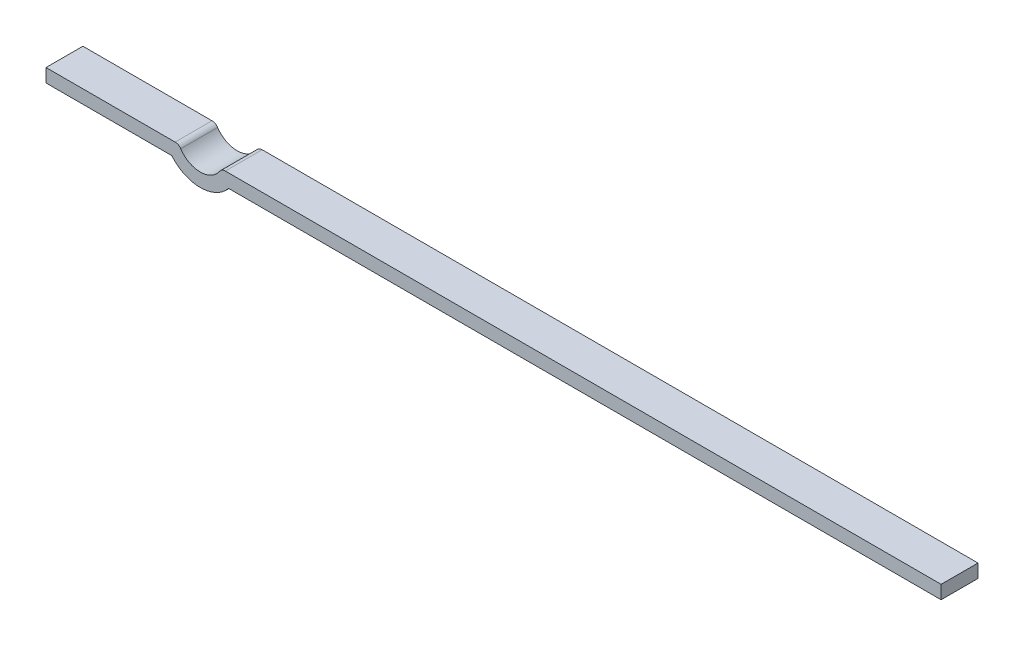
ISO-10303-21;
HEADER;
FILE_DESCRIPTION(('STEP AP214'),'2;1');
FILE_NAME('part.step','',(''),(''),'','','');
FILE_SCHEMA(('AUTOMOTIVE_DESIGN { 1 0 10303 214 1 1 1 1 }'));
ENDSEC;
DATA;
#1=APPLICATION_CONTEXT('core data for automotive mechanical design processes');
#2=APPLICATION_PROTOCOL_DEFINITION('international standard','automotive_design',2000,#1);
#3=PRODUCT_CONTEXT('',#1,'mechanical');
#4=PRODUCT('Part','Part','',(#3));
#5=PRODUCT_RELATED_PRODUCT_CATEGORY('part','',(#4));
#6=PRODUCT_DEFINITION_FORMATION('','',#4);
#7=PRODUCT_DEFINITION_CONTEXT('part definition',#1,'design');
#8=PRODUCT_DEFINITION('design','',#6,#7);
#9=PRODUCT_DEFINITION_SHAPE('','',#8);
#10=(LENGTH_UNIT() NAMED_UNIT(*) SI_UNIT(.MILLI.,.METRE.));
#11=(NAMED_UNIT(*) PLANE_ANGLE_UNIT() SI_UNIT($,.RADIAN.));
#12=(NAMED_UNIT(*) SI_UNIT($,.STERADIAN.) SOLID_ANGLE_UNIT());
#13=UNCERTAINTY_MEASURE_WITH_UNIT(LENGTH_MEASURE(1.E-05),#10,'distance_accuracy_value','');
#14=(GEOMETRIC_REPRESENTATION_CONTEXT(3) GLOBAL_UNCERTAINTY_ASSIGNED_CONTEXT((#13)) GLOBAL_UNIT_ASSIGNED_CONTEXT((#10,
#11,#12)) REPRESENTATION_CONTEXT('',''));
#15=CARTESIAN_POINT('',(0.,0.,0.));
#16=DIRECTION('',(0.,0.,1.));
#17=DIRECTION('',(1.,0.,0.));
#18=AXIS2_PLACEMENT_3D('',#15,#16,#17);
#19=CARTESIAN_POINT('',(6.675,-0.1,0.55));
#20=DIRECTION('',(-1.,0.,0.));
#21=DIRECTION('',(0.,0.,1.));
#22=AXIS2_PLACEMENT_3D('',#19,#20,#21);
#23=PLANE('',#22);
#24=DIRECTION('',(0.,1.,0.));
#25=VECTOR('',#24,1.);
#26=CARTESIAN_POINT('',(6.675,-0.1,0.));
#27=LINE('',#26,#25);
#28=CARTESIAN_POINT('',(6.675,-0.1,0.));
#29=VERTEX_POINT('',#28);
#30=CARTESIAN_POINT('',(6.675,0.1,0.));
#31=VERTEX_POINT('',#30);
#32=EDGE_CURVE('E140',#29,#31,#27,.T.);
#33=ORIENTED_EDGE('',*,*,#32,.T.);
#34=DIRECTION('',(0.,0.,-1.));
#35=VECTOR('',#34,1.);
#36=CARTESIAN_POINT('',(6.675,0.1,0.55));
#37=LINE('',#36,#35);
#38=CARTESIAN_POINT('',(6.675,0.1,0.55));
#39=VERTEX_POINT('',#38);
#40=EDGE_CURVE('E11',#39,#31,#37,.T.);
#41=ORIENTED_EDGE('',*,*,#40,.F.);
#42=DIRECTION('',(0.,1.,0.));
#43=VECTOR('',#42,1.);
#44=CARTESIAN_POINT('',(6.675,-0.1,0.55));
#45=LINE('',#44,#43);
#46=CARTESIAN_POINT('',(6.675,-0.1,0.55));
#47=VERTEX_POINT('',#46);
#48=EDGE_CURVE('E158',#47,#39,#45,.T.);
#49=ORIENTED_EDGE('',*,*,#48,.F.);
#50=DIRECTION('',(0.,0.,-1.));
#51=VECTOR('',#50,1.);
#52=CARTESIAN_POINT('',(6.675,-0.1,0.55));
#53=LINE('',#52,#51);
#54=EDGE_CURVE('E136',#47,#29,#53,.T.);
#55=ORIENTED_EDGE('',*,*,#54,.T.);
#56=EDGE_LOOP('',(#33,#41,#49,#55));
#57=FACE_BOUND('',#56,.T.);
#58=ADVANCED_FACE('F32',(#57),#23,.F.);
#59=CARTESIAN_POINT('',(-4.00059565600384,0.1,0.55));
#60=DIRECTION('',(0.,-1.,0.));
#61=DIRECTION('',(1.,0.,0.));
#62=AXIS2_PLACEMENT_3D('',#59,#60,#61);
#63=PLANE('',#62);
#64=DIRECTION('',(-1.,0.,0.));
#65=VECTOR('',#64,1.);
#66=CARTESIAN_POINT('',(-4.00059565600384,0.1,0.));
#67=LINE('',#66,#65);
#68=CARTESIAN_POINT('',(-4.00059565600384,0.1,0.));
#69=VERTEX_POINT('',#68);
#70=EDGE_CURVE('E143',#31,#69,#67,.T.);
#71=ORIENTED_EDGE('',*,*,#70,.T.);
#72=DIRECTION('',(0.,0.,-1.));
#73=VECTOR('',#72,1.);
#74=CARTESIAN_POINT('',(-4.00059565600384,0.1,0.55));
#75=LINE('',#74,#73);
#76=CARTESIAN_POINT('',(-4.00059565600384,0.1,0.55));
#77=VERTEX_POINT('',#76);
#78=EDGE_CURVE('E40',#77,#69,#75,.T.);
#79=ORIENTED_EDGE('',*,*,#78,.F.);
#80=DIRECTION('',(-1.,0.,0.));
#81=VECTOR('',#80,1.);
#82=CARTESIAN_POINT('',(-4.00059565600384,0.1,0.55));
#83=LINE('',#82,#81);
#84=EDGE_CURVE('E97',#39,#77,#83,.T.);
#85=ORIENTED_EDGE('',*,*,#84,.F.);
#86=ORIENTED_EDGE('',*,*,#40,.T.);
#87=EDGE_LOOP('',(#71,#79,#85,#86));
#88=FACE_BOUND('',#87,.T.);
#89=ADVANCED_FACE('F207',(#88),#63,.F.);
#90=CARTESIAN_POINT('',(-4.00059565600384,0.,0.55));
#91=DIRECTION('',(0.,0.,-1.));
#92=DIRECTION('',(-1.,0.,0.));
#93=AXIS2_PLACEMENT_3D('',#90,#91,#92);
#94=CYLINDRICAL_SURFACE('',#93,0.1);
#95=CARTESIAN_POINT('',(-4.00059565600384,0.,0.));
#96=DIRECTION('',(0.,0.,1.));
#97=DIRECTION('',(-1.,0.,0.));
#98=AXIS2_PLACEMENT_3D('',#95,#96,#97);
#99=CIRCLE('',#98,0.1);
#100=CARTESIAN_POINT('',(-4.08374106578076,0.0555593451457745,0.));
#101=VERTEX_POINT('',#100);
#102=EDGE_CURVE('E145',#69,#101,#99,.T.);
#103=ORIENTED_EDGE('',*,*,#102,.T.);
#104=DIRECTION('',(0.,0.,-1.));
#105=VECTOR('',#104,1.);
#106=CARTESIAN_POINT('',(-4.08374106578076,0.0555593451457745,0.55));
#107=LINE('',#106,#105);
#108=CARTESIAN_POINT('',(-4.08374106578076,0.0555593451457745,0.55));
#109=VERTEX_POINT('',#108);
#110=EDGE_CURVE('E171',#109,#101,#107,.T.);
#111=ORIENTED_EDGE('',*,*,#110,.F.);
#112=CARTESIAN_POINT('',(-4.00059565600384,0.,0.55));
#113=DIRECTION('',(0.,0.,1.));
#114=DIRECTION('',(-1.,0.,0.));
#115=AXIS2_PLACEMENT_3D('',#112,#113,#114);
#116=CIRCLE('',#115,0.1);
#117=EDGE_CURVE('E179',#77,#109,#116,.T.);
#118=ORIENTED_EDGE('',*,*,#117,.F.);
#119=ORIENTED_EDGE('',*,*,#78,.T.);
#120=EDGE_LOOP('',(#103,#111,#118,#119));
#121=FACE_BOUND('',#120,.T.);
#122=ADVANCED_FACE('F177',(#121),#94,.T.);
#123=CARTESIAN_POINT('',(-4.37475,0.250017053155985,0.55));
#124=DIRECTION('',(0.,0.,-1.));
#125=DIRECTION('',(-1.,0.,0.));
#126=AXIS2_PLACEMENT_3D('',#123,#124,#125);
#127=CYLINDRICAL_SURFACE('',#126,0.35);
#128=CARTESIAN_POINT('',(-4.37475,0.250017053155985,0.));
#129=DIRECTION('',(0.,0.,-1.));
#130=DIRECTION('',(1.,0.,0.));
#131=AXIS2_PLACEMENT_3D('',#128,#129,#130);
#132=CIRCLE('',#131,0.35);
#133=CARTESIAN_POINT('',(-4.66575893421924,0.0555593451457747,0.));
#134=VERTEX_POINT('',#133);
#135=EDGE_CURVE('E147',#101,#134,#132,.T.);
#136=ORIENTED_EDGE('',*,*,#135,.T.);
#137=DIRECTION('',(0.,0.,-1.));
#138=VECTOR('',#137,1.);
#139=CARTESIAN_POINT('',(-4.66575893421924,0.0555593451457747,0.55));
#140=LINE('',#139,#138);
#141=CARTESIAN_POINT('',(-4.66575893421924,0.0555593451457747,0.55));
#142=VERTEX_POINT('',#141);
#143=EDGE_CURVE('E168',#142,#134,#140,.T.);
#144=ORIENTED_EDGE('',*,*,#143,.F.);
#145=CARTESIAN_POINT('',(-4.37475,0.250017053155985,0.55));
#146=DIRECTION('',(0.,0.,-1.));
#147=DIRECTION('',(1.,0.,0.));
#148=AXIS2_PLACEMENT_3D('',#145,#146,#147);
#149=CIRCLE('',#148,0.35);
#150=EDGE_CURVE('E197',#109,#142,#149,.T.);
#151=ORIENTED_EDGE('',*,*,#150,.F.);
#152=ORIENTED_EDGE('',*,*,#110,.T.);
#153=EDGE_LOOP('',(#136,#144,#151,#152));
#154=FACE_BOUND('',#153,.T.);
#155=ADVANCED_FACE('F188',(#154),#127,.F.);
#156=CARTESIAN_POINT('',(-4.74890434399616,0.,0.55));
#157=DIRECTION('',(0.,0.,-1.));
#158=DIRECTION('',(-1.,0.,0.));
#159=AXIS2_PLACEMENT_3D('',#156,#157,#158);
#160=CYLINDRICAL_SURFACE('',#159,0.1);
#161=CARTESIAN_POINT('',(-4.74890434399616,0.,0.));
#162=DIRECTION('',(0.,0.,1.));
#163=DIRECTION('',(1.,0.,0.));
#164=AXIS2_PLACEMENT_3D('',#161,#162,#163);
#165=CIRCLE('',#164,0.1);
#166=CARTESIAN_POINT('',(-4.74890434399616,0.1,0.));
#167=VERTEX_POINT('',#166);
#168=EDGE_CURVE('E149',#134,#167,#165,.T.);
#169=ORIENTED_EDGE('',*,*,#168,.T.);
#170=DIRECTION('',(0.,0.,-1.));
#171=VECTOR('',#170,1.);
#172=CARTESIAN_POINT('',(-4.74890434399616,0.1,0.55));
#173=LINE('',#172,#171);
#174=CARTESIAN_POINT('',(-4.74890434399616,0.1,0.55));
#175=VERTEX_POINT('',#174);
#176=EDGE_CURVE('E165',#175,#167,#173,.T.);
#177=ORIENTED_EDGE('',*,*,#176,.F.);
#178=CARTESIAN_POINT('',(-4.74890434399616,0.,0.55));
#179=DIRECTION('',(0.,0.,1.));
#180=DIRECTION('',(1.,0.,0.));
#181=AXIS2_PLACEMENT_3D('',#178,#179,#180);
#182=CIRCLE('',#181,0.1);
#183=EDGE_CURVE('E194',#142,#175,#182,.T.);
#184=ORIENTED_EDGE('',*,*,#183,.F.);
#185=ORIENTED_EDGE('',*,*,#143,.T.);
#186=EDGE_LOOP('',(#169,#177,#184,#185));
#187=FACE_BOUND('',#186,.T.);
#188=ADVANCED_FACE('F192',(#187),#160,.T.);
#189=CARTESIAN_POINT('',(-6.675,0.1,0.55));
#190=DIRECTION('',(0.,-1.,0.));
#191=DIRECTION('',(1.,0.,0.));
#192=AXIS2_PLACEMENT_3D('',#189,#190,#191);
#193=PLANE('',#192);
#194=DIRECTION('',(-1.,0.,0.));
#195=VECTOR('',#194,1.);
#196=CARTESIAN_POINT('',(-6.675,0.1,0.));
#197=LINE('',#196,#195);
#198=CARTESIAN_POINT('',(-6.675,0.1,0.));
#199=VERTEX_POINT('',#198);
#200=EDGE_CURVE('E151',#167,#199,#197,.T.);
#201=ORIENTED_EDGE('',*,*,#200,.T.);
#202=DIRECTION('',(0.,0.,-1.));
#203=VECTOR('',#202,1.);
#204=CARTESIAN_POINT('',(-6.675,0.1,0.55));
#205=LINE('',#204,#203);
#206=CARTESIAN_POINT('',(-6.675,0.1,0.55));
#207=VERTEX_POINT('',#206);
#208=EDGE_CURVE('E162',#207,#199,#205,.T.);
#209=ORIENTED_EDGE('',*,*,#208,.F.);
#210=DIRECTION('',(-1.,0.,0.));
#211=VECTOR('',#210,1.);
#212=CARTESIAN_POINT('',(-6.675,0.1,0.55));
#213=LINE('',#212,#211);
#214=EDGE_CURVE('E196',#175,#207,#213,.T.);
#215=ORIENTED_EDGE('',*,*,#214,.F.);
#216=ORIENTED_EDGE('',*,*,#176,.T.);
#217=EDGE_LOOP('',(#201,#209,#215,#216));
#218=FACE_BOUND('',#217,.T.);
#219=ADVANCED_FACE('F219',(#218),#193,.F.);
#220=CARTESIAN_POINT('',(-6.675,-0.1,0.55));
#221=DIRECTION('',(1.,0.,0.));
#222=DIRECTION('',(0.,0.,-1.));
#223=AXIS2_PLACEMENT_3D('',#220,#221,#222);
#224=PLANE('',#223);
#225=DIRECTION('',(0.,-1.,0.));
#226=VECTOR('',#225,1.);
#227=CARTESIAN_POINT('',(-6.675,-0.1,0.));
#228=LINE('',#227,#226);
#229=CARTESIAN_POINT('',(-6.675,-0.1,0.));
#230=VERTEX_POINT('',#229);
#231=EDGE_CURVE('E153',#199,#230,#228,.T.);
#232=ORIENTED_EDGE('',*,*,#231,.T.);
#233=DIRECTION('',(0.,0.,-1.));
#234=VECTOR('',#233,1.);
#235=CARTESIAN_POINT('',(-6.675,-0.1,0.55));
#236=LINE('',#235,#234);
#237=CARTESIAN_POINT('',(-6.675,-0.1,0.55));
#238=VERTEX_POINT('',#237);
#239=EDGE_CURVE('E131',#238,#230,#236,.T.);
#240=ORIENTED_EDGE('',*,*,#239,.F.);
#241=DIRECTION('',(0.,-1.,0.));
#242=VECTOR('',#241,1.);
#243=CARTESIAN_POINT('',(-6.675,-0.1,0.55));
#244=LINE('',#243,#242);
#245=EDGE_CURVE('E122',#207,#238,#244,.T.);
#246=ORIENTED_EDGE('',*,*,#245,.F.);
#247=ORIENTED_EDGE('',*,*,#208,.T.);
#248=EDGE_LOOP('',(#232,#240,#246,#247));
#249=FACE_BOUND('',#248,.T.);
#250=ADVANCED_FACE('F222',(#249),#224,.F.);
#251=CARTESIAN_POINT('',(-6.675,-0.1,0.55));
#252=DIRECTION('',(0.,1.,0.));
#253=DIRECTION('',(0.,0.,1.));
#254=AXIS2_PLACEMENT_3D('',#251,#252,#253);
#255=PLANE('',#254);
#256=DIRECTION('',(1.,0.,0.));
#257=VECTOR('',#256,1.);
#258=CARTESIAN_POINT('',(-6.675,-0.1,0.));
#259=LINE('',#258,#257);
#260=CARTESIAN_POINT('',(-4.799,-0.1,0.));
#261=VERTEX_POINT('',#260);
#262=EDGE_CURVE('E130',#230,#261,#259,.T.);
#263=ORIENTED_EDGE('',*,*,#262,.T.);
#264=DIRECTION('',(0.,0.,-1.));
#265=VECTOR('',#264,1.);
#266=CARTESIAN_POINT('',(-4.799,-0.1,0.55));
#267=LINE('',#266,#265);
#268=CARTESIAN_POINT('',(-4.799,-0.1,0.55));
#269=VERTEX_POINT('',#268);
#270=EDGE_CURVE('E127',#269,#261,#267,.T.);
#271=ORIENTED_EDGE('',*,*,#270,.F.);
#272=DIRECTION('',(1.,0.,0.));
#273=VECTOR('',#272,1.);
#274=CARTESIAN_POINT('',(-6.675,-0.1,0.55));
#275=LINE('',#274,#273);
#276=EDGE_CURVE('E116',#238,#269,#275,.T.);
#277=ORIENTED_EDGE('',*,*,#276,.F.);
#278=ORIENTED_EDGE('',*,*,#239,.T.);
#279=EDGE_LOOP('',(#263,#271,#277,#278));
#280=FACE_BOUND('',#279,.T.);
#281=ADVANCED_FACE('F128',(#280),#255,.F.);
#282=CARTESIAN_POINT('',(-4.37475,0.250017053155985,0.55));
#283=DIRECTION('',(0.,0.,-1.));
#284=DIRECTION('',(-1.,0.,0.));
#285=AXIS2_PLACEMENT_3D('',#282,#283,#284);
#286=CYLINDRICAL_SURFACE('',#285,0.55);
#287=CARTESIAN_POINT('',(-4.37475,0.250017053155985,0.));
#288=DIRECTION('',(0.,0.,1.));
#289=DIRECTION('',(-1.,0.,0.));
#290=AXIS2_PLACEMENT_3D('',#287,#288,#289);
#291=CIRCLE('',#290,0.55);
#292=CARTESIAN_POINT('',(-3.9505,-0.0999999999999999,0.));
#293=VERTEX_POINT('',#292);
#294=EDGE_CURVE('E83',#261,#293,#291,.T.);
#295=ORIENTED_EDGE('',*,*,#294,.T.);
#296=DIRECTION('',(0.,0.,-1.));
#297=VECTOR('',#296,1.);
#298=CARTESIAN_POINT('',(-3.9505,-0.0999999999999999,0.55));
#299=LINE('',#298,#297);
#300=CARTESIAN_POINT('',(-3.9505,-0.0999999999999999,0.55));
#301=VERTEX_POINT('',#300);
#302=EDGE_CURVE('E132',#301,#293,#299,.T.);
#303=ORIENTED_EDGE('',*,*,#302,.F.);
#304=CARTESIAN_POINT('',(-4.37475,0.250017053155985,0.55));
#305=DIRECTION('',(0.,0.,1.));
#306=DIRECTION('',(-1.,0.,0.));
#307=AXIS2_PLACEMENT_3D('',#304,#305,#306);
#308=CIRCLE('',#307,0.55);
#309=EDGE_CURVE('E120',#269,#301,#308,.T.);
#310=ORIENTED_EDGE('',*,*,#309,.F.);
#311=ORIENTED_EDGE('',*,*,#270,.T.);
#312=EDGE_LOOP('',(#295,#303,#310,#311));
#313=FACE_BOUND('',#312,.T.);
#314=ADVANCED_FACE('F134',(#313),#286,.T.);
#315=CARTESIAN_POINT('',(-3.9505,-0.1,0.55));
#316=DIRECTION('',(0.,1.,0.));
#317=DIRECTION('',(0.,0.,1.));
#318=AXIS2_PLACEMENT_3D('',#315,#316,#317);
#319=PLANE('',#318);
#320=DIRECTION('',(1.,0.,0.));
#321=VECTOR('',#320,1.);
#322=CARTESIAN_POINT('',(-3.9505,-0.1,0.));
#323=LINE('',#322,#321);
#324=EDGE_CURVE('E89',#293,#29,#323,.T.);
#325=ORIENTED_EDGE('',*,*,#324,.T.);
#326=ORIENTED_EDGE('',*,*,#54,.F.);
#327=DIRECTION('',(1.,0.,0.));
#328=VECTOR('',#327,1.);
#329=CARTESIAN_POINT('',(-3.9505,-0.1,0.55));
#330=LINE('',#329,#328);
#331=EDGE_CURVE('E48',#301,#47,#330,.T.);
#332=ORIENTED_EDGE('',*,*,#331,.F.);
#333=ORIENTED_EDGE('',*,*,#302,.T.);
#334=EDGE_LOOP('',(#325,#326,#332,#333));
#335=FACE_BOUND('',#334,.T.);
#336=ADVANCED_FACE('F231',(#335),#319,.F.);
#337=CARTESIAN_POINT('',(-4.00059565600384,0.,0.55));
#338=DIRECTION('',(0.,0.,-1.));
#339=DIRECTION('',(-1.,0.,0.));
#340=AXIS2_PLACEMENT_3D('',#337,#338,#339);
#341=PLANE('',#340);
#342=ORIENTED_EDGE('',*,*,#48,.T.);
#343=ORIENTED_EDGE('',*,*,#84,.T.);
#344=ORIENTED_EDGE('',*,*,#117,.T.);
#345=ORIENTED_EDGE('',*,*,#150,.T.);
#346=ORIENTED_EDGE('',*,*,#183,.T.);
#347=ORIENTED_EDGE('',*,*,#214,.T.);
#348=ORIENTED_EDGE('',*,*,#245,.T.);
#349=ORIENTED_EDGE('',*,*,#276,.T.);
#350=ORIENTED_EDGE('',*,*,#309,.T.);
#351=ORIENTED_EDGE('',*,*,#331,.T.);
#352=EDGE_LOOP('',(#342,#343,#344,#345,#346,#347,#348,#349,#350,#351));
#353=FACE_BOUND('',#352,.T.);
#354=ADVANCED_FACE('F118',(#353),#341,.F.);
#355=CARTESIAN_POINT('',(-4.00059565600384,0.,0.));
#356=DIRECTION('',(0.,0.,-1.));
#357=DIRECTION('',(-1.,0.,0.));
#358=AXIS2_PLACEMENT_3D('',#355,#356,#357);
#359=PLANE('',#358);
#360=ORIENTED_EDGE('',*,*,#32,.F.);
#361=ORIENTED_EDGE('',*,*,#324,.F.);
#362=ORIENTED_EDGE('',*,*,#294,.F.);
#363=ORIENTED_EDGE('',*,*,#262,.F.);
#364=ORIENTED_EDGE('',*,*,#231,.F.);
#365=ORIENTED_EDGE('',*,*,#200,.F.);
#366=ORIENTED_EDGE('',*,*,#168,.F.);
#367=ORIENTED_EDGE('',*,*,#135,.F.);
#368=ORIENTED_EDGE('',*,*,#102,.F.);
#369=ORIENTED_EDGE('',*,*,#70,.F.);
#370=EDGE_LOOP('',(#360,#361,#362,#363,#364,#365,#366,#367,#368,#369));
#371=FACE_BOUND('',#370,.T.);
#372=ADVANCED_FACE('F183',(#371),#359,.T.);
#373=CLOSED_SHELL('',(#58,#89,#122,#155,#188,#219,#250,#281,#314,#336,#354,#372));
#374=MANIFOLD_SOLID_BREP('B2',#373);
#375=ADVANCED_BREP_SHAPE_REPRESENTATION('',(#18,#374),#14);
#376=SHAPE_DEFINITION_REPRESENTATION(#9,#375);
ENDSEC;
END-ISO-10303-21;
